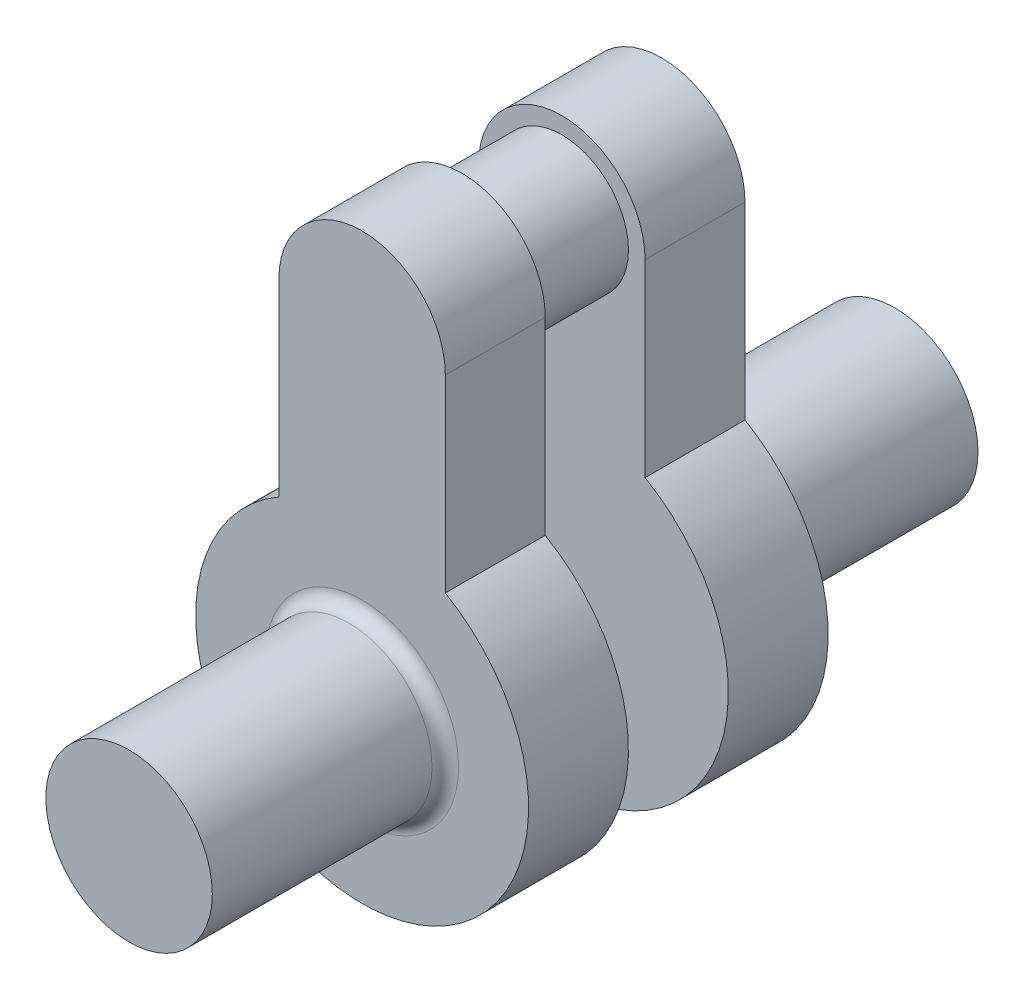
ISO-10303-21;
HEADER;
FILE_DESCRIPTION(('STEP AP214'),'2;1');
FILE_NAME('part.step','',(''),(''),'','','');
FILE_SCHEMA(('AUTOMOTIVE_DESIGN { 1 0 10303 214 1 1 1 1 }'));
ENDSEC;
DATA;
#1=APPLICATION_CONTEXT('core data for automotive mechanical design processes');
#2=APPLICATION_PROTOCOL_DEFINITION('international standard','automotive_design',2000,#1);
#3=PRODUCT_CONTEXT('',#1,'mechanical');
#4=PRODUCT('Part','Part','',(#3));
#5=PRODUCT_RELATED_PRODUCT_CATEGORY('part','',(#4));
#6=PRODUCT_DEFINITION_FORMATION('','',#4);
#7=PRODUCT_DEFINITION_CONTEXT('part definition',#1,'design');
#8=PRODUCT_DEFINITION('design','',#6,#7);
#9=PRODUCT_DEFINITION_SHAPE('','',#8);
#10=(LENGTH_UNIT() NAMED_UNIT(*) SI_UNIT(.MILLI.,.METRE.));
#11=(NAMED_UNIT(*) PLANE_ANGLE_UNIT() SI_UNIT($,.RADIAN.));
#12=(NAMED_UNIT(*) SI_UNIT($,.STERADIAN.) SOLID_ANGLE_UNIT());
#13=UNCERTAINTY_MEASURE_WITH_UNIT(LENGTH_MEASURE(1.E-05),#10,'distance_accuracy_value','');
#14=(GEOMETRIC_REPRESENTATION_CONTEXT(3) GLOBAL_UNCERTAINTY_ASSIGNED_CONTEXT((#13)) GLOBAL_UNIT_ASSIGNED_CONTEXT((#10,
#11,#12)) REPRESENTATION_CONTEXT('',''));
#15=CARTESIAN_POINT('',(0.,0.,0.));
#16=DIRECTION('',(0.,0.,1.));
#17=DIRECTION('',(1.,0.,0.));
#18=AXIS2_PLACEMENT_3D('',#15,#16,#17);
#19=CARTESIAN_POINT('',(0.,50.,15.));
#20=DIRECTION('',(0.,0.,-1.));
#21=DIRECTION('',(-1.,0.,0.));
#22=AXIS2_PLACEMENT_3D('',#19,#20,#21);
#23=CYLINDRICAL_SURFACE('',#22,12.5);
#24=CARTESIAN_POINT('',(0.,50.,0.));
#25=DIRECTION('',(0.,0.,1.));
#26=DIRECTION('',(1.,0.,0.));
#27=AXIS2_PLACEMENT_3D('',#24,#25,#26);
#28=CIRCLE('',#27,12.5);
#29=CARTESIAN_POINT('',(12.5,50.,0.));
#30=VERTEX_POINT('',#29);
#31=CARTESIAN_POINT('',(-12.5,50.,0.));
#32=VERTEX_POINT('',#31);
#33=EDGE_CURVE('E162',#30,#32,#28,.T.);
#34=ORIENTED_EDGE('',*,*,#33,.T.);
#35=DIRECTION('',(0.,0.,-1.));
#36=VECTOR('',#35,1.);
#37=CARTESIAN_POINT('',(-12.5,50.,15.));
#38=LINE('',#37,#36);
#39=CARTESIAN_POINT('',(-12.5,50.,15.));
#40=VERTEX_POINT('',#39);
#41=EDGE_CURVE('E181',#40,#32,#38,.T.);
#42=ORIENTED_EDGE('',*,*,#41,.F.);
#43=CARTESIAN_POINT('',(0.,50.,15.));
#44=DIRECTION('',(0.,0.,1.));
#45=DIRECTION('',(1.,0.,0.));
#46=AXIS2_PLACEMENT_3D('',#43,#44,#45);
#47=CIRCLE('',#46,12.5);
#48=CARTESIAN_POINT('',(12.5,50.,15.));
#49=VERTEX_POINT('',#48);
#50=EDGE_CURVE('E163',#49,#40,#47,.T.);
#51=ORIENTED_EDGE('',*,*,#50,.F.);
#52=DIRECTION('',(0.,0.,-1.));
#53=VECTOR('',#52,1.);
#54=CARTESIAN_POINT('',(12.5,50.,15.));
#55=LINE('',#54,#53);
#56=EDGE_CURVE('E169',#49,#30,#55,.T.);
#57=ORIENTED_EDGE('',*,*,#56,.T.);
#58=EDGE_LOOP('',(#34,#42,#51,#57));
#59=FACE_BOUND('',#58,.T.);
#60=ADVANCED_FACE('F36',(#59),#23,.T.);
#61=CARTESIAN_POINT('',(-12.5,50.,15.));
#62=DIRECTION('',(1.,0.,0.));
#63=DIRECTION('',(0.,1.,0.));
#64=AXIS2_PLACEMENT_3D('',#61,#62,#63);
#65=PLANE('',#64);
#66=DIRECTION('',(0.,-1.,0.));
#67=VECTOR('',#66,1.);
#68=CARTESIAN_POINT('',(-12.5,50.,0.));
#69=LINE('',#68,#67);
#70=CARTESIAN_POINT('',(-12.5,21.650635094611,0.));
#71=VERTEX_POINT('',#70);
#72=EDGE_CURVE('E172',#32,#71,#69,.T.);
#73=ORIENTED_EDGE('',*,*,#72,.T.);
#74=DIRECTION('',(0.,0.,-1.));
#75=VECTOR('',#74,1.);
#76=CARTESIAN_POINT('',(-12.5,21.650635094611,15.));
#77=LINE('',#76,#75);
#78=CARTESIAN_POINT('',(-12.5,21.650635094611,15.));
#79=VERTEX_POINT('',#78);
#80=EDGE_CURVE('E179',#79,#71,#77,.T.);
#81=ORIENTED_EDGE('',*,*,#80,.F.);
#82=DIRECTION('',(0.,-1.,0.));
#83=VECTOR('',#82,1.);
#84=CARTESIAN_POINT('',(-12.5,50.,15.));
#85=LINE('',#84,#83);
#86=EDGE_CURVE('E85',#40,#79,#85,.T.);
#87=ORIENTED_EDGE('',*,*,#86,.F.);
#88=ORIENTED_EDGE('',*,*,#41,.T.);
#89=EDGE_LOOP('',(#73,#81,#87,#88));
#90=FACE_BOUND('',#89,.T.);
#91=ADVANCED_FACE('F207',(#90),#65,.F.);
#92=CARTESIAN_POINT('',(0.,0.,15.));
#93=DIRECTION('',(0.,0.,-1.));
#94=DIRECTION('',(-1.,0.,0.));
#95=AXIS2_PLACEMENT_3D('',#92,#93,#94);
#96=CYLINDRICAL_SURFACE('',#95,25.);
#97=CARTESIAN_POINT('',(0.,0.,0.));
#98=DIRECTION('',(0.,0.,1.));
#99=DIRECTION('',(1.,0.,0.));
#100=AXIS2_PLACEMENT_3D('',#97,#98,#99);
#101=CIRCLE('',#100,25.);
#102=CARTESIAN_POINT('',(12.5,21.650635094611,0.));
#103=VERTEX_POINT('',#102);
#104=EDGE_CURVE('E71',#71,#103,#101,.T.);
#105=ORIENTED_EDGE('',*,*,#104,.T.);
#106=DIRECTION('',(0.,0.,-1.));
#107=VECTOR('',#106,1.);
#108=CARTESIAN_POINT('',(12.5,21.650635094611,15.));
#109=LINE('',#108,#107);
#110=CARTESIAN_POINT('',(12.5,21.650635094611,15.));
#111=VERTEX_POINT('',#110);
#112=EDGE_CURVE('E177',#111,#103,#109,.T.);
#113=ORIENTED_EDGE('',*,*,#112,.F.);
#114=CARTESIAN_POINT('',(0.,0.,15.));
#115=DIRECTION('',(0.,0.,1.));
#116=DIRECTION('',(1.,0.,0.));
#117=AXIS2_PLACEMENT_3D('',#114,#115,#116);
#118=CIRCLE('',#117,25.);
#119=EDGE_CURVE('E166',#79,#111,#118,.T.);
#120=ORIENTED_EDGE('',*,*,#119,.F.);
#121=ORIENTED_EDGE('',*,*,#80,.T.);
#122=EDGE_LOOP('',(#105,#113,#120,#121));
#123=FACE_BOUND('',#122,.T.);
#124=ADVANCED_FACE('F213',(#123),#96,.T.);
#125=CARTESIAN_POINT('',(12.5,50.,15.));
#126=DIRECTION('',(-1.,0.,0.));
#127=DIRECTION('',(0.,-1.,0.));
#128=AXIS2_PLACEMENT_3D('',#125,#126,#127);
#129=PLANE('',#128);
#130=DIRECTION('',(0.,1.,0.));
#131=VECTOR('',#130,1.);
#132=CARTESIAN_POINT('',(12.5,50.,0.));
#133=LINE('',#132,#131);
#134=EDGE_CURVE('E77',#103,#30,#133,.T.);
#135=ORIENTED_EDGE('',*,*,#134,.T.);
#136=ORIENTED_EDGE('',*,*,#56,.F.);
#137=DIRECTION('',(0.,1.,0.));
#138=VECTOR('',#137,1.);
#139=CARTESIAN_POINT('',(12.5,50.,15.));
#140=LINE('',#139,#138);
#141=EDGE_CURVE('E53',#111,#49,#140,.T.);
#142=ORIENTED_EDGE('',*,*,#141,.F.);
#143=ORIENTED_EDGE('',*,*,#112,.T.);
#144=EDGE_LOOP('',(#135,#136,#142,#143));
#145=FACE_BOUND('',#144,.T.);
#146=ADVANCED_FACE('F247',(#145),#129,.F.);
#147=CARTESIAN_POINT('',(0.,50.,15.));
#148=DIRECTION('',(0.,0.,1.));
#149=DIRECTION('',(1.,0.,0.));
#150=AXIS2_PLACEMENT_3D('',#147,#148,#149);
#151=PLANE('',#150);
#152=CARTESIAN_POINT('',(0.,0.,15.));
#153=DIRECTION('',(0.,0.,1.));
#154=DIRECTION('',(1.,0.,0.));
#155=AXIS2_PLACEMENT_3D('',#152,#153,#154);
#156=CIRCLE('',#155,14.5);
#157=CARTESIAN_POINT('',(14.5,0.,15.));
#158=VERTEX_POINT('',#157);
#159=EDGE_CURVE('E186',#158,#158,#156,.F.);
#160=ORIENTED_EDGE('',*,*,#159,.T.);
#161=EDGE_LOOP('',(#160));
#162=FACE_BOUND('',#161,.T.);
#163=ORIENTED_EDGE('',*,*,#50,.T.);
#164=ORIENTED_EDGE('',*,*,#86,.T.);
#165=ORIENTED_EDGE('',*,*,#119,.T.);
#166=ORIENTED_EDGE('',*,*,#141,.T.);
#167=EDGE_LOOP('',(#163,#164,#165,#166));
#168=FACE_BOUND('',#167,.T.);
#169=ADVANCED_FACE('F242',(#162,#168),#151,.T.);
#170=CARTESIAN_POINT('',(0.,50.,0.));
#171=DIRECTION('',(0.,0.,1.));
#172=DIRECTION('',(1.,0.,0.));
#173=AXIS2_PLACEMENT_3D('',#170,#171,#172);
#174=PLANE('',#173);
#175=CARTESIAN_POINT('',(0.,50.,0.));
#176=DIRECTION('',(0.,0.,1.));
#177=DIRECTION('',(1.,0.,0.));
#178=AXIS2_PLACEMENT_3D('',#175,#176,#177);
#179=CIRCLE('',#178,10.);
#180=CARTESIAN_POINT('',(10.,50.,0.));
#181=VERTEX_POINT('',#180);
#182=EDGE_CURVE('E189',#181,#181,#179,.F.);
#183=ORIENTED_EDGE('',*,*,#182,.F.);
#184=EDGE_LOOP('',(#183));
#185=FACE_BOUND('',#184,.T.);
#186=ORIENTED_EDGE('',*,*,#33,.F.);
#187=ORIENTED_EDGE('',*,*,#134,.F.);
#188=ORIENTED_EDGE('',*,*,#104,.F.);
#189=ORIENTED_EDGE('',*,*,#72,.F.);
#190=EDGE_LOOP('',(#186,#187,#188,#189));
#191=FACE_BOUND('',#190,.T.);
#192=ADVANCED_FACE('F236',(#185,#191),#174,.F.);
#193=CARTESIAN_POINT('',(0.,0.,50.));
#194=DIRECTION('',(0.,0.,-1.));
#195=DIRECTION('',(-1.,0.,0.));
#196=AXIS2_PLACEMENT_3D('',#193,#194,#195);
#197=CYLINDRICAL_SURFACE('',#196,12.5);
#198=CARTESIAN_POINT('',(0.,0.,17.));
#199=DIRECTION('',(0.,0.,1.));
#200=DIRECTION('',(1.,0.,0.));
#201=AXIS2_PLACEMENT_3D('',#198,#199,#200);
#202=CIRCLE('',#201,12.5);
#203=CARTESIAN_POINT('',(12.5,0.,17.));
#204=VERTEX_POINT('',#203);
#205=EDGE_CURVE('E183',#204,#204,#202,.T.);
#206=ORIENTED_EDGE('',*,*,#205,.T.);
#207=EDGE_LOOP('',(#206));
#208=FACE_BOUND('',#207,.T.);
#209=CARTESIAN_POINT('',(0.,0.,50.));
#210=DIRECTION('',(0.,0.,1.));
#211=DIRECTION('',(1.,0.,0.));
#212=AXIS2_PLACEMENT_3D('',#209,#210,#211);
#213=CIRCLE('',#212,12.5);
#214=CARTESIAN_POINT('',(12.5,0.,50.));
#215=VERTEX_POINT('',#214);
#216=EDGE_CURVE('E159',#215,#215,#213,.T.);
#217=ORIENTED_EDGE('',*,*,#216,.F.);
#218=EDGE_LOOP('',(#217));
#219=FACE_BOUND('',#218,.T.);
#220=ADVANCED_FACE('F227',(#208,#219),#197,.T.);
#221=CARTESIAN_POINT('',(0.,0.,50.));
#222=DIRECTION('',(0.,0.,1.));
#223=DIRECTION('',(1.,0.,0.));
#224=AXIS2_PLACEMENT_3D('',#221,#222,#223);
#225=PLANE('',#224);
#226=ORIENTED_EDGE('',*,*,#216,.T.);
#227=EDGE_LOOP('',(#226));
#228=FACE_BOUND('',#227,.T.);
#229=ADVANCED_FACE('F219',(#228),#225,.T.);
#230=CARTESIAN_POINT('',(0.,0.,17.));
#231=DIRECTION('',(0.,0.,1.));
#232=DIRECTION('',(1.,0.,0.));
#233=AXIS2_PLACEMENT_3D('',#230,#231,#232);
#234=TOROIDAL_SURFACE('',#233,14.5,2.);
#235=ORIENTED_EDGE('',*,*,#159,.F.);
#236=EDGE_LOOP('',(#235));
#237=FACE_BOUND('',#236,.T.);
#238=ORIENTED_EDGE('',*,*,#205,.F.);
#239=EDGE_LOOP('',(#238));
#240=FACE_BOUND('',#239,.T.);
#241=ADVANCED_FACE('F216',(#237,#240),#234,.F.);
#242=CARTESIAN_POINT('',(0.,50.,-15.));
#243=DIRECTION('',(0.,0.,1.));
#244=DIRECTION('',(1.,0.,0.));
#245=AXIS2_PLACEMENT_3D('',#242,#243,#244);
#246=CYLINDRICAL_SURFACE('',#245,10.);
#247=CARTESIAN_POINT('',(0.,50.,-15.));
#248=DIRECTION('',(0.,0.,-1.));
#249=DIRECTION('',(-1.,0.,0.));
#250=AXIS2_PLACEMENT_3D('',#247,#248,#249);
#251=CIRCLE('',#250,10.);
#252=CARTESIAN_POINT('',(-10.,50.,-15.));
#253=VERTEX_POINT('',#252);
#254=EDGE_CURVE('E123',#253,#253,#251,.T.);
#255=ORIENTED_EDGE('',*,*,#254,.F.);
#256=EDGE_LOOP('',(#255));
#257=FACE_BOUND('',#256,.T.);
#258=ORIENTED_EDGE('',*,*,#182,.T.);
#259=EDGE_LOOP('',(#258));
#260=FACE_BOUND('',#259,.T.);
#261=ADVANCED_FACE('F218',(#257,#260),#246,.T.);
#262=CARTESIAN_POINT('',(0.,50.,-30.));
#263=DIRECTION('',(0.,0.,1.));
#264=DIRECTION('',(1.,0.,0.));
#265=AXIS2_PLACEMENT_3D('',#262,#263,#264);
#266=CYLINDRICAL_SURFACE('',#265,12.5);
#267=CARTESIAN_POINT('',(0.,50.,-15.));
#268=DIRECTION('',(0.,0.,1.));
#269=DIRECTION('',(1.,0.,0.));
#270=AXIS2_PLACEMENT_3D('',#267,#268,#269);
#271=CIRCLE('',#270,12.5);
#272=CARTESIAN_POINT('',(12.5,50.,-15.));
#273=VERTEX_POINT('',#272);
#274=CARTESIAN_POINT('',(-12.5,50.,-15.));
#275=VERTEX_POINT('',#274);
#276=EDGE_CURVE('E118',#273,#275,#271,.T.);
#277=ORIENTED_EDGE('',*,*,#276,.F.);
#278=DIRECTION('',(0.,0.,1.));
#279=VECTOR('',#278,1.);
#280=CARTESIAN_POINT('',(12.5,50.,-30.));
#281=LINE('',#280,#279);
#282=CARTESIAN_POINT('',(12.5,50.,-30.));
#283=VERTEX_POINT('',#282);
#284=EDGE_CURVE('E112',#283,#273,#281,.T.);
#285=ORIENTED_EDGE('',*,*,#284,.F.);
#286=CARTESIAN_POINT('',(0.,50.,-30.));
#287=DIRECTION('',(0.,0.,1.));
#288=DIRECTION('',(1.,0.,0.));
#289=AXIS2_PLACEMENT_3D('',#286,#287,#288);
#290=CIRCLE('',#289,12.5);
#291=CARTESIAN_POINT('',(-12.5,50.,-30.));
#292=VERTEX_POINT('',#291);
#293=EDGE_CURVE('E115',#283,#292,#290,.T.);
#294=ORIENTED_EDGE('',*,*,#293,.T.);
#295=DIRECTION('',(0.,0.,1.));
#296=VECTOR('',#295,1.);
#297=CARTESIAN_POINT('',(-12.5,50.,-30.));
#298=LINE('',#297,#296);
#299=EDGE_CURVE('E143',#292,#275,#298,.T.);
#300=ORIENTED_EDGE('',*,*,#299,.T.);
#301=EDGE_LOOP('',(#277,#285,#294,#300));
#302=FACE_BOUND('',#301,.T.);
#303=ADVANCED_FACE('F114',(#302),#266,.T.);
#304=CARTESIAN_POINT('',(12.5,50.,-30.));
#305=DIRECTION('',(1.,0.,0.));
#306=DIRECTION('',(0.,1.,0.));
#307=AXIS2_PLACEMENT_3D('',#304,#305,#306);
#308=PLANE('',#307);
#309=DIRECTION('',(0.,1.,0.));
#310=VECTOR('',#309,1.);
#311=CARTESIAN_POINT('',(12.5,50.,-15.));
#312=LINE('',#311,#310);
#313=CARTESIAN_POINT('',(12.5,21.650635094611,-15.));
#314=VERTEX_POINT('',#313);
#315=EDGE_CURVE('E145',#314,#273,#312,.T.);
#316=ORIENTED_EDGE('',*,*,#315,.F.);
#317=DIRECTION('',(0.,0.,1.));
#318=VECTOR('',#317,1.);
#319=CARTESIAN_POINT('',(12.5,21.650635094611,-30.));
#320=LINE('',#319,#318);
#321=CARTESIAN_POINT('',(12.5,21.650635094611,-30.));
#322=VERTEX_POINT('',#321);
#323=EDGE_CURVE('E124',#322,#314,#320,.T.);
#324=ORIENTED_EDGE('',*,*,#323,.F.);
#325=DIRECTION('',(0.,1.,0.));
#326=VECTOR('',#325,1.);
#327=CARTESIAN_POINT('',(12.5,50.,-30.));
#328=LINE('',#327,#326);
#329=EDGE_CURVE('E130',#322,#283,#328,.T.);
#330=ORIENTED_EDGE('',*,*,#329,.T.);
#331=ORIENTED_EDGE('',*,*,#284,.T.);
#332=EDGE_LOOP('',(#316,#324,#330,#331));
#333=FACE_BOUND('',#332,.T.);
#334=ADVANCED_FACE('F136',(#333),#308,.T.);
#335=CARTESIAN_POINT('',(0.,0.,-30.));
#336=DIRECTION('',(0.,0.,1.));
#337=DIRECTION('',(1.,0.,0.));
#338=AXIS2_PLACEMENT_3D('',#335,#336,#337);
#339=CYLINDRICAL_SURFACE('',#338,25.);
#340=CARTESIAN_POINT('',(0.,0.,-15.));
#341=DIRECTION('',(0.,0.,1.));
#342=DIRECTION('',(1.,0.,0.));
#343=AXIS2_PLACEMENT_3D('',#340,#341,#342);
#344=CIRCLE('',#343,25.);
#345=CARTESIAN_POINT('',(-12.5,21.650635094611,-15.));
#346=VERTEX_POINT('',#345);
#347=EDGE_CURVE('E148',#346,#314,#344,.T.);
#348=ORIENTED_EDGE('',*,*,#347,.F.);
#349=DIRECTION('',(0.,0.,1.));
#350=VECTOR('',#349,1.);
#351=CARTESIAN_POINT('',(-12.5,21.650635094611,-30.));
#352=LINE('',#351,#350);
#353=CARTESIAN_POINT('',(-12.5,21.650635094611,-30.));
#354=VERTEX_POINT('',#353);
#355=EDGE_CURVE('E154',#354,#346,#352,.T.);
#356=ORIENTED_EDGE('',*,*,#355,.F.);
#357=CARTESIAN_POINT('',(0.,0.,-30.));
#358=DIRECTION('',(0.,0.,1.));
#359=DIRECTION('',(1.,0.,0.));
#360=AXIS2_PLACEMENT_3D('',#357,#358,#359);
#361=CIRCLE('',#360,25.);
#362=EDGE_CURVE('E137',#354,#322,#361,.T.);
#363=ORIENTED_EDGE('',*,*,#362,.T.);
#364=ORIENTED_EDGE('',*,*,#323,.T.);
#365=EDGE_LOOP('',(#348,#356,#363,#364));
#366=FACE_BOUND('',#365,.T.);
#367=ADVANCED_FACE('F295',(#366),#339,.T.);
#368=CARTESIAN_POINT('',(-12.5,50.,-30.));
#369=DIRECTION('',(-1.,0.,0.));
#370=DIRECTION('',(0.,-1.,0.));
#371=AXIS2_PLACEMENT_3D('',#368,#369,#370);
#372=PLANE('',#371);
#373=DIRECTION('',(0.,-1.,0.));
#374=VECTOR('',#373,1.);
#375=CARTESIAN_POINT('',(-12.5,50.,-15.));
#376=LINE('',#375,#374);
#377=EDGE_CURVE('E134',#275,#346,#376,.T.);
#378=ORIENTED_EDGE('',*,*,#377,.F.);
#379=ORIENTED_EDGE('',*,*,#299,.F.);
#380=DIRECTION('',(0.,-1.,0.));
#381=VECTOR('',#380,1.);
#382=CARTESIAN_POINT('',(-12.5,50.,-30.));
#383=LINE('',#382,#381);
#384=EDGE_CURVE('E133',#292,#354,#383,.T.);
#385=ORIENTED_EDGE('',*,*,#384,.T.);
#386=ORIENTED_EDGE('',*,*,#355,.T.);
#387=EDGE_LOOP('',(#378,#379,#385,#386));
#388=FACE_BOUND('',#387,.T.);
#389=ADVANCED_FACE('F304',(#388),#372,.T.);
#390=CARTESIAN_POINT('',(0.,50.,-30.));
#391=DIRECTION('',(0.,0.,-1.));
#392=DIRECTION('',(1.,0.,0.));
#393=AXIS2_PLACEMENT_3D('',#390,#391,#392);
#394=PLANE('',#393);
#395=CARTESIAN_POINT('',(0.,0.,-30.));
#396=DIRECTION('',(0.,0.,-1.));
#397=DIRECTION('',(-1.,0.,0.));
#398=AXIS2_PLACEMENT_3D('',#395,#396,#397);
#399=CIRCLE('',#398,14.5);
#400=CARTESIAN_POINT('',(-14.5,0.,-30.));
#401=VERTEX_POINT('',#400);
#402=EDGE_CURVE('E11',#401,#401,#399,.F.);
#403=ORIENTED_EDGE('',*,*,#402,.T.);
#404=EDGE_LOOP('',(#403));
#405=FACE_BOUND('',#404,.T.);
#406=ORIENTED_EDGE('',*,*,#293,.F.);
#407=ORIENTED_EDGE('',*,*,#329,.F.);
#408=ORIENTED_EDGE('',*,*,#362,.F.);
#409=ORIENTED_EDGE('',*,*,#384,.F.);
#410=EDGE_LOOP('',(#406,#407,#408,#409));
#411=FACE_BOUND('',#410,.T.);
#412=ADVANCED_FACE('F128',(#405,#411),#394,.T.);
#413=CARTESIAN_POINT('',(0.,50.,-15.));
#414=DIRECTION('',(0.,0.,-1.));
#415=DIRECTION('',(1.,0.,0.));
#416=AXIS2_PLACEMENT_3D('',#413,#414,#415);
#417=PLANE('',#416);
#418=ORIENTED_EDGE('',*,*,#254,.T.);
#419=EDGE_LOOP('',(#418));
#420=FACE_BOUND('',#419,.T.);
#421=ORIENTED_EDGE('',*,*,#276,.T.);
#422=ORIENTED_EDGE('',*,*,#377,.T.);
#423=ORIENTED_EDGE('',*,*,#347,.T.);
#424=ORIENTED_EDGE('',*,*,#315,.T.);
#425=EDGE_LOOP('',(#421,#422,#423,#424));
#426=FACE_BOUND('',#425,.T.);
#427=ADVANCED_FACE('F323',(#420,#426),#417,.F.);
#428=CARTESIAN_POINT('',(0.,0.,-65.));
#429=DIRECTION('',(0.,0.,1.));
#430=DIRECTION('',(1.,0.,0.));
#431=AXIS2_PLACEMENT_3D('',#428,#429,#430);
#432=CYLINDRICAL_SURFACE('',#431,12.5);
#433=CARTESIAN_POINT('',(0.,0.,-32.));
#434=DIRECTION('',(0.,0.,-1.));
#435=DIRECTION('',(-1.,0.,0.));
#436=AXIS2_PLACEMENT_3D('',#433,#434,#435);
#437=CIRCLE('',#436,12.5);
#438=CARTESIAN_POINT('',(-12.5,0.,-32.));
#439=VERTEX_POINT('',#438);
#440=EDGE_CURVE('E45',#439,#439,#437,.T.);
#441=ORIENTED_EDGE('',*,*,#440,.T.);
#442=EDGE_LOOP('',(#441));
#443=FACE_BOUND('',#442,.T.);
#444=CARTESIAN_POINT('',(0.,0.,-65.));
#445=DIRECTION('',(0.,0.,1.));
#446=DIRECTION('',(1.,0.,0.));
#447=AXIS2_PLACEMENT_3D('',#444,#445,#446);
#448=CIRCLE('',#447,12.5);
#449=CARTESIAN_POINT('',(12.5,0.,-65.));
#450=VERTEX_POINT('',#449);
#451=EDGE_CURVE('E146',#450,#450,#448,.T.);
#452=ORIENTED_EDGE('',*,*,#451,.T.);
#453=EDGE_LOOP('',(#452));
#454=FACE_BOUND('',#453,.T.);
#455=ADVANCED_FACE('F194',(#443,#454),#432,.T.);
#456=CARTESIAN_POINT('',(0.,0.,-65.));
#457=DIRECTION('',(0.,0.,-1.));
#458=DIRECTION('',(1.,0.,0.));
#459=AXIS2_PLACEMENT_3D('',#456,#457,#458);
#460=PLANE('',#459);
#461=ORIENTED_EDGE('',*,*,#451,.F.);
#462=EDGE_LOOP('',(#461));
#463=FACE_BOUND('',#462,.T.);
#464=ADVANCED_FACE('F198',(#463),#460,.T.);
#465=CARTESIAN_POINT('',(0.,0.,-32.));
#466=DIRECTION('',(0.,0.,-1.));
#467=DIRECTION('',(-1.,0.,0.));
#468=AXIS2_PLACEMENT_3D('',#465,#466,#467);
#469=TOROIDAL_SURFACE('',#468,14.5,2.);
#470=ORIENTED_EDGE('',*,*,#402,.F.);
#471=EDGE_LOOP('',(#470));
#472=FACE_BOUND('',#471,.T.);
#473=ORIENTED_EDGE('',*,*,#440,.F.);
#474=EDGE_LOOP('',(#473));
#475=FACE_BOUND('',#474,.T.);
#476=ADVANCED_FACE('F38',(#472,#475),#469,.F.);
#477=CLOSED_SHELL('',(#60,#91,#124,#146,#169,#192,#220,#229,#241,#261,#303,#334,#367,#389,#412,
#427,#455,#464,#476));
#478=MANIFOLD_SOLID_BREP('B2',#477);
#479=ADVANCED_BREP_SHAPE_REPRESENTATION('',(#18,#478),#14);
#480=SHAPE_DEFINITION_REPRESENTATION(#9,#479);
ENDSEC;
END-ISO-10303-21;
